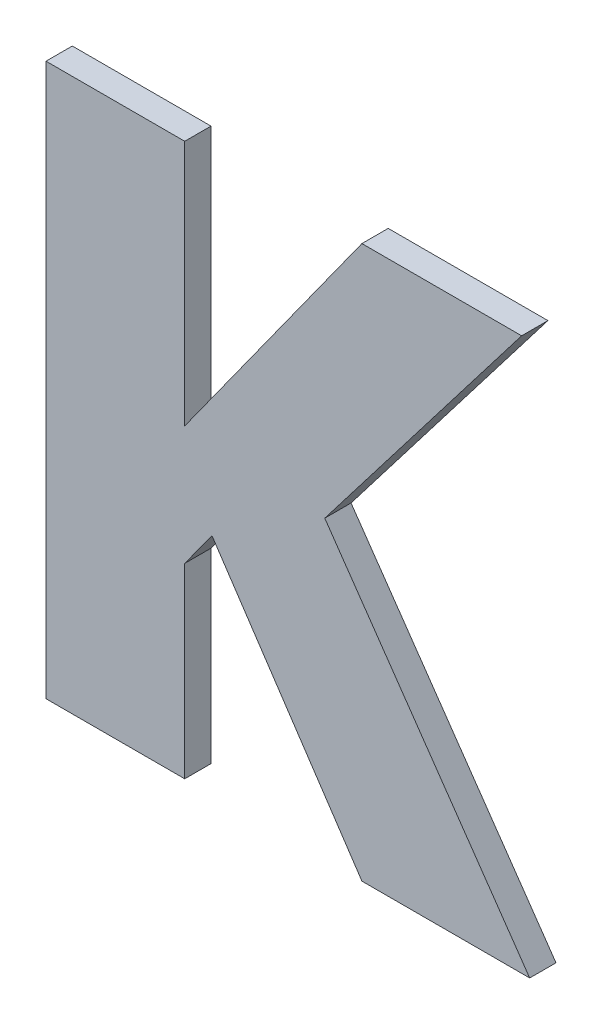
ISO-10303-21;
HEADER;
FILE_DESCRIPTION(('STEP AP214'),'2;1');
FILE_NAME('part.step','',(''),(''),'','','');
FILE_SCHEMA(('AUTOMOTIVE_DESIGN { 1 0 10303 214 1 1 1 1 }'));
ENDSEC;
DATA;
#1=APPLICATION_CONTEXT('core data for automotive mechanical design processes');
#2=APPLICATION_PROTOCOL_DEFINITION('international standard','automotive_design',2000,#1);
#3=PRODUCT_CONTEXT('',#1,'mechanical');
#4=PRODUCT('Part','Part','',(#3));
#5=PRODUCT_RELATED_PRODUCT_CATEGORY('part','',(#4));
#6=PRODUCT_DEFINITION_FORMATION('','',#4);
#7=PRODUCT_DEFINITION_CONTEXT('part definition',#1,'design');
#8=PRODUCT_DEFINITION('design','',#6,#7);
#9=PRODUCT_DEFINITION_SHAPE('','',#8);
#10=(LENGTH_UNIT() NAMED_UNIT(*) SI_UNIT(.MILLI.,.METRE.));
#11=(NAMED_UNIT(*) PLANE_ANGLE_UNIT() SI_UNIT($,.RADIAN.));
#12=(NAMED_UNIT(*) SI_UNIT($,.STERADIAN.) SOLID_ANGLE_UNIT());
#13=UNCERTAINTY_MEASURE_WITH_UNIT(LENGTH_MEASURE(1.E-05),#10,'distance_accuracy_value','');
#14=(GEOMETRIC_REPRESENTATION_CONTEXT(3) GLOBAL_UNCERTAINTY_ASSIGNED_CONTEXT((#13)) GLOBAL_UNIT_ASSIGNED_CONTEXT((#10,
#11,#12)) REPRESENTATION_CONTEXT('',''));
#15=CARTESIAN_POINT('',(0.,0.,0.));
#16=DIRECTION('',(0.,0.,1.));
#17=DIRECTION('',(1.,0.,0.));
#18=AXIS2_PLACEMENT_3D('',#15,#16,#17);
#19=CARTESIAN_POINT('',(3.9258033080139,-3.1428783858346,0.0475));
#20=DIRECTION('',(-0.831283694214455,-0.555848378366951,0.));
#21=DIRECTION('',(0.555848378366951,-0.831283694214455,0.));
#22=AXIS2_PLACEMENT_3D('',#19,#20,#21);
#23=PLANE('',#22);
#24=DIRECTION('',(-0.555848378366951,0.831283694214455,0.));
#25=VECTOR('',#24,1.);
#26=CARTESIAN_POINT('',(3.9543081693605,-3.1855080441471,0.0475));
#27=LINE('',#26,#25);
#28=CARTESIAN_POINT('',(3.9543081693605,-3.1855080441471,0.0475));
#29=VERTEX_POINT('',#28);
#30=CARTESIAN_POINT('',(3.9258033080139,-3.1428783858346,0.0475));
#31=VERTEX_POINT('',#30);
#32=EDGE_CURVE('E11',#29,#31,#27,.T.);
#33=ORIENTED_EDGE('',*,*,#32,.F.);
#34=DIRECTION('',(0.,0.,1.));
#35=VECTOR('',#34,1.);
#36=CARTESIAN_POINT('',(3.9543081693605,-3.1855080441471,0.0475));
#37=LINE('',#36,#35);
#38=CARTESIAN_POINT('',(3.9543081693605,-3.1855080441471,0.0525));
#39=VERTEX_POINT('',#38);
#40=EDGE_CURVE('E24',#29,#39,#37,.T.);
#41=ORIENTED_EDGE('',*,*,#40,.T.);
#42=DIRECTION('',(0.555848378366951,-0.831283694214455,0.));
#43=VECTOR('',#42,1.);
#44=CARTESIAN_POINT('',(3.9543081693605,-3.1855080441471,0.0525));
#45=LINE('',#44,#43);
#46=CARTESIAN_POINT('',(3.9258033080139,-3.1428783858346,0.0525));
#47=VERTEX_POINT('',#46);
#48=EDGE_CURVE('E124',#47,#39,#45,.T.);
#49=ORIENTED_EDGE('',*,*,#48,.F.);
#50=DIRECTION('',(0.,0.,1.));
#51=VECTOR('',#50,1.);
#52=CARTESIAN_POINT('',(3.9258033080139,-3.1428783858346,0.0475));
#53=LINE('',#52,#51);
#54=EDGE_CURVE('E197',#31,#47,#53,.T.);
#55=ORIENTED_EDGE('',*,*,#54,.F.);
#56=EDGE_LOOP('',(#33,#41,#49,#55));
#57=FACE_BOUND('',#56,.T.);
#58=ADVANCED_FACE('F17',(#57),#23,.T.);
#59=CARTESIAN_POINT('',(3.9206128705746,-3.1500258734559,0.0475));
#60=DIRECTION('',(0.809152433574184,-0.587598791047918,0.));
#61=DIRECTION('',(0.587598791047918,0.809152433574184,0.));
#62=AXIS2_PLACEMENT_3D('',#59,#60,#61);
#63=PLANE('',#62);
#64=DIRECTION('',(-0.587598791047918,-0.809152433574184,0.));
#65=VECTOR('',#64,1.);
#66=CARTESIAN_POINT('',(3.9258033080139,-3.1428783858346,0.0475));
#67=LINE('',#66,#65);
#68=CARTESIAN_POINT('',(3.9206128705746,-3.1500258734559,0.0475));
#69=VERTEX_POINT('',#68);
#70=EDGE_CURVE('E195',#31,#69,#67,.T.);
#71=ORIENTED_EDGE('',*,*,#70,.F.);
#72=ORIENTED_EDGE('',*,*,#54,.T.);
#73=DIRECTION('',(0.587598791047918,0.809152433574184,0.));
#74=VECTOR('',#73,1.);
#75=CARTESIAN_POINT('',(3.9258033080139,-3.1428783858346,0.0525));
#76=LINE('',#75,#74);
#77=CARTESIAN_POINT('',(3.9206128705746,-3.1500258734559,0.0525));
#78=VERTEX_POINT('',#77);
#79=EDGE_CURVE('E193',#78,#47,#76,.T.);
#80=ORIENTED_EDGE('',*,*,#79,.F.);
#81=DIRECTION('',(0.,0.,1.));
#82=VECTOR('',#81,1.);
#83=CARTESIAN_POINT('',(3.9206128705746,-3.1500258734559,0.0475));
#84=LINE('',#83,#82);
#85=EDGE_CURVE('E190',#69,#78,#84,.T.);
#86=ORIENTED_EDGE('',*,*,#85,.F.);
#87=EDGE_LOOP('',(#71,#72,#80,#86));
#88=FACE_BOUND('',#87,.T.);
#89=ADVANCED_FACE('F235',(#88),#63,.T.);
#90=CARTESIAN_POINT('',(3.9206128705746,-3.1855080441471,0.0475));
#91=DIRECTION('',(1.,0.,0.));
#92=DIRECTION('',(0.,1.,0.));
#93=AXIS2_PLACEMENT_3D('',#90,#91,#92);
#94=PLANE('',#93);
#95=DIRECTION('',(0.,-1.,0.));
#96=VECTOR('',#95,1.);
#97=CARTESIAN_POINT('',(3.9206128705746,-3.1500258734559,0.0475));
#98=LINE('',#97,#96);
#99=CARTESIAN_POINT('',(3.9206128705746,-3.1855080441471,0.0475));
#100=VERTEX_POINT('',#99);
#101=EDGE_CURVE('E188',#69,#100,#98,.T.);
#102=ORIENTED_EDGE('',*,*,#101,.F.);
#103=ORIENTED_EDGE('',*,*,#85,.T.);
#104=DIRECTION('',(0.,1.,0.));
#105=VECTOR('',#104,1.);
#106=CARTESIAN_POINT('',(3.9206128705746,-3.1500258734559,0.0525));
#107=LINE('',#106,#105);
#108=CARTESIAN_POINT('',(3.9206128705746,-3.1855080441471,0.0525));
#109=VERTEX_POINT('',#108);
#110=EDGE_CURVE('E185',#109,#78,#107,.T.);
#111=ORIENTED_EDGE('',*,*,#110,.F.);
#112=DIRECTION('',(0.,0.,1.));
#113=VECTOR('',#112,1.);
#114=CARTESIAN_POINT('',(3.9206128705746,-3.1855080441471,0.0475));
#115=LINE('',#114,#113);
#116=EDGE_CURVE('E182',#100,#109,#115,.T.);
#117=ORIENTED_EDGE('',*,*,#116,.F.);
#118=EDGE_LOOP('',(#102,#103,#111,#117));
#119=FACE_BOUND('',#118,.T.);
#120=ADVANCED_FACE('F231',(#119),#94,.T.);
#121=CARTESIAN_POINT('',(3.8942352376867,-3.1855080441471,0.0475));
#122=DIRECTION('',(0.,-1.,0.));
#123=DIRECTION('',(1.,0.,0.));
#124=AXIS2_PLACEMENT_3D('',#121,#122,#123);
#125=PLANE('',#124);
#126=DIRECTION('',(-1.,0.,0.));
#127=VECTOR('',#126,1.);
#128=CARTESIAN_POINT('',(3.9206128705746,-3.1855080441471,0.0475));
#129=LINE('',#128,#127);
#130=CARTESIAN_POINT('',(3.8942352376867,-3.1855080441471,0.0475));
#131=VERTEX_POINT('',#130);
#132=EDGE_CURVE('E180',#100,#131,#129,.T.);
#133=ORIENTED_EDGE('',*,*,#132,.F.);
#134=ORIENTED_EDGE('',*,*,#116,.T.);
#135=DIRECTION('',(1.,0.,0.));
#136=VECTOR('',#135,1.);
#137=CARTESIAN_POINT('',(3.9206128705746,-3.1855080441471,0.0525));
#138=LINE('',#137,#136);
#139=CARTESIAN_POINT('',(3.8942352376867,-3.1855080441471,0.0525));
#140=VERTEX_POINT('',#139);
#141=EDGE_CURVE('E177',#140,#109,#138,.T.);
#142=ORIENTED_EDGE('',*,*,#141,.F.);
#143=DIRECTION('',(0.,0.,1.));
#144=VECTOR('',#143,1.);
#145=CARTESIAN_POINT('',(3.8942352376867,-3.1855080441471,0.0475));
#146=LINE('',#145,#144);
#147=EDGE_CURVE('E174',#131,#140,#146,.T.);
#148=ORIENTED_EDGE('',*,*,#147,.F.);
#149=EDGE_LOOP('',(#133,#134,#142,#148));
#150=FACE_BOUND('',#149,.T.);
#151=ADVANCED_FACE('F227',(#150),#125,.T.);
#152=CARTESIAN_POINT('',(3.8942352376867,-3.0805080474254,0.0475));
#153=DIRECTION('',(-1.,0.,0.));
#154=DIRECTION('',(0.,-1.,0.));
#155=AXIS2_PLACEMENT_3D('',#152,#153,#154);
#156=PLANE('',#155);
#157=DIRECTION('',(0.,1.,0.));
#158=VECTOR('',#157,1.);
#159=CARTESIAN_POINT('',(3.8942352376867,-3.1855080441471,0.0475));
#160=LINE('',#159,#158);
#161=CARTESIAN_POINT('',(3.8942352376867,-3.0805080474254,0.0475));
#162=VERTEX_POINT('',#161);
#163=EDGE_CURVE('E172',#131,#162,#160,.T.);
#164=ORIENTED_EDGE('',*,*,#163,.F.);
#165=ORIENTED_EDGE('',*,*,#147,.T.);
#166=DIRECTION('',(0.,-1.,0.));
#167=VECTOR('',#166,1.);
#168=CARTESIAN_POINT('',(3.8942352376867,-3.1855080441471,0.0525));
#169=LINE('',#168,#167);
#170=CARTESIAN_POINT('',(3.8942352376867,-3.0805080474254,0.0525));
#171=VERTEX_POINT('',#170);
#172=EDGE_CURVE('E169',#171,#140,#169,.T.);
#173=ORIENTED_EDGE('',*,*,#172,.F.);
#174=DIRECTION('',(0.,0.,1.));
#175=VECTOR('',#174,1.);
#176=CARTESIAN_POINT('',(3.8942352376867,-3.0805080474254,0.0475));
#177=LINE('',#176,#175);
#178=EDGE_CURVE('E166',#162,#171,#177,.T.);
#179=ORIENTED_EDGE('',*,*,#178,.F.);
#180=EDGE_LOOP('',(#164,#165,#173,#179));
#181=FACE_BOUND('',#180,.T.);
#182=ADVANCED_FACE('F223',(#181),#156,.T.);
#183=CARTESIAN_POINT('',(3.9206128705746,-3.0805080474254,0.0475));
#184=DIRECTION('',(0.,1.,0.));
#185=DIRECTION('',(-1.,0.,0.));
#186=AXIS2_PLACEMENT_3D('',#183,#184,#185);
#187=PLANE('',#186);
#188=DIRECTION('',(1.,0.,0.));
#189=VECTOR('',#188,1.);
#190=CARTESIAN_POINT('',(3.8942352376867,-3.0805080474254,0.0475));
#191=LINE('',#190,#189);
#192=CARTESIAN_POINT('',(3.9206128705746,-3.0805080474254,0.0475));
#193=VERTEX_POINT('',#192);
#194=EDGE_CURVE('E164',#162,#193,#191,.T.);
#195=ORIENTED_EDGE('',*,*,#194,.F.);
#196=ORIENTED_EDGE('',*,*,#178,.T.);
#197=DIRECTION('',(-1.,0.,0.));
#198=VECTOR('',#197,1.);
#199=CARTESIAN_POINT('',(3.8942352376867,-3.0805080474254,0.0525));
#200=LINE('',#199,#198);
#201=CARTESIAN_POINT('',(3.9206128705746,-3.0805080474254,0.0525));
#202=VERTEX_POINT('',#201);
#203=EDGE_CURVE('E161',#202,#171,#200,.T.);
#204=ORIENTED_EDGE('',*,*,#203,.F.);
#205=DIRECTION('',(0.,0.,1.));
#206=VECTOR('',#205,1.);
#207=CARTESIAN_POINT('',(3.9206128705746,-3.0805080474254,0.0475));
#208=LINE('',#207,#206);
#209=EDGE_CURVE('E158',#193,#202,#208,.T.);
#210=ORIENTED_EDGE('',*,*,#209,.F.);
#211=EDGE_LOOP('',(#195,#196,#204,#210));
#212=FACE_BOUND('',#211,.T.);
#213=ADVANCED_FACE('F219',(#212),#187,.T.);
#214=CARTESIAN_POINT('',(3.9206128705746,-3.1273921626552,0.0475));
#215=DIRECTION('',(1.,0.,0.));
#216=DIRECTION('',(0.,1.,0.));
#217=AXIS2_PLACEMENT_3D('',#214,#215,#216);
#218=PLANE('',#217);
#219=DIRECTION('',(0.,-1.,0.));
#220=VECTOR('',#219,1.);
#221=CARTESIAN_POINT('',(3.9206128705746,-3.0805080474254,0.0475));
#222=LINE('',#221,#220);
#223=CARTESIAN_POINT('',(3.9206128705746,-3.1273921626552,0.0475));
#224=VERTEX_POINT('',#223);
#225=EDGE_CURVE('E156',#193,#224,#222,.T.);
#226=ORIENTED_EDGE('',*,*,#225,.F.);
#227=ORIENTED_EDGE('',*,*,#209,.T.);
#228=DIRECTION('',(0.,1.,0.));
#229=VECTOR('',#228,1.);
#230=CARTESIAN_POINT('',(3.9206128705746,-3.0805080474254,0.0525));
#231=LINE('',#230,#229);
#232=CARTESIAN_POINT('',(3.9206128705746,-3.1273921626552,0.0525));
#233=VERTEX_POINT('',#232);
#234=EDGE_CURVE('E153',#233,#202,#231,.T.);
#235=ORIENTED_EDGE('',*,*,#234,.F.);
#236=DIRECTION('',(0.,0.,1.));
#237=VECTOR('',#236,1.);
#238=CARTESIAN_POINT('',(3.9206128705746,-3.1273921626552,0.0475));
#239=LINE('',#238,#237);
#240=EDGE_CURVE('E150',#224,#233,#239,.T.);
#241=ORIENTED_EDGE('',*,*,#240,.F.);
#242=EDGE_LOOP('',(#226,#227,#235,#241));
#243=FACE_BOUND('',#242,.T.);
#244=ADVANCED_FACE('F215',(#243),#218,.T.);
#245=CARTESIAN_POINT('',(3.9543081693605,-3.0805080474254,0.0475));
#246=DIRECTION('',(-0.812037197104277,0.583605680677484,0.));
#247=DIRECTION('',(-0.583605680677484,-0.812037197104277,0.));
#248=AXIS2_PLACEMENT_3D('',#245,#246,#247);
#249=PLANE('',#248);
#250=DIRECTION('',(0.583605680677484,0.812037197104277,0.));
#251=VECTOR('',#250,1.);
#252=CARTESIAN_POINT('',(3.9206128705746,-3.1273921626552,0.0475));
#253=LINE('',#252,#251);
#254=CARTESIAN_POINT('',(3.9543081693605,-3.0805080474254,0.0475));
#255=VERTEX_POINT('',#254);
#256=EDGE_CURVE('E148',#224,#255,#253,.T.);
#257=ORIENTED_EDGE('',*,*,#256,.F.);
#258=ORIENTED_EDGE('',*,*,#240,.T.);
#259=DIRECTION('',(-0.583605680677484,-0.812037197104277,0.));
#260=VECTOR('',#259,1.);
#261=CARTESIAN_POINT('',(3.9206128705746,-3.1273921626552,0.0525));
#262=LINE('',#261,#260);
#263=CARTESIAN_POINT('',(3.9543081693605,-3.0805080474254,0.0525));
#264=VERTEX_POINT('',#263);
#265=EDGE_CURVE('E145',#264,#233,#262,.T.);
#266=ORIENTED_EDGE('',*,*,#265,.F.);
#267=DIRECTION('',(0.,0.,1.));
#268=VECTOR('',#267,1.);
#269=CARTESIAN_POINT('',(3.9543081693605,-3.0805080474254,0.0475));
#270=LINE('',#269,#268);
#271=EDGE_CURVE('E142',#255,#264,#270,.T.);
#272=ORIENTED_EDGE('',*,*,#271,.F.);
#273=EDGE_LOOP('',(#257,#258,#266,#272));
#274=FACE_BOUND('',#273,.T.);
#275=ADVANCED_FACE('F211',(#274),#249,.T.);
#276=CARTESIAN_POINT('',(3.9846849917509,-3.0805080474254,0.0475));
#277=DIRECTION('',(0.,1.,0.));
#278=DIRECTION('',(-1.,0.,0.));
#279=AXIS2_PLACEMENT_3D('',#276,#277,#278);
#280=PLANE('',#279);
#281=DIRECTION('',(1.,0.,0.));
#282=VECTOR('',#281,1.);
#283=CARTESIAN_POINT('',(3.9543081693605,-3.0805080474254,0.0475));
#284=LINE('',#283,#282);
#285=CARTESIAN_POINT('',(3.9846849917509,-3.0805080474254,0.0475));
#286=VERTEX_POINT('',#285);
#287=EDGE_CURVE('E140',#255,#286,#284,.T.);
#288=ORIENTED_EDGE('',*,*,#287,.F.);
#289=ORIENTED_EDGE('',*,*,#271,.T.);
#290=DIRECTION('',(-1.,0.,0.));
#291=VECTOR('',#290,1.);
#292=CARTESIAN_POINT('',(3.9543081693605,-3.0805080474254,0.0525));
#293=LINE('',#292,#291);
#294=CARTESIAN_POINT('',(3.9846849917509,-3.0805080474254,0.0525));
#295=VERTEX_POINT('',#294);
#296=EDGE_CURVE('E137',#295,#264,#293,.T.);
#297=ORIENTED_EDGE('',*,*,#296,.F.);
#298=DIRECTION('',(0.,0.,1.));
#299=VECTOR('',#298,1.);
#300=CARTESIAN_POINT('',(3.9846849917509,-3.0805080474254,0.0475));
#301=LINE('',#300,#299);
#302=EDGE_CURVE('E134',#286,#295,#301,.T.);
#303=ORIENTED_EDGE('',*,*,#302,.F.);
#304=EDGE_LOOP('',(#288,#289,#297,#303));
#305=FACE_BOUND('',#304,.T.);
#306=ADVANCED_FACE('F207',(#305),#280,.T.);
#307=CARTESIAN_POINT('',(3.9472457708776,-3.1292641236989,0.0475));
#308=DIRECTION('',(0.793138273917805,-0.609041606498838,0.));
#309=DIRECTION('',(0.609041606498838,0.793138273917805,0.));
#310=AXIS2_PLACEMENT_3D('',#307,#308,#309);
#311=PLANE('',#310);
#312=DIRECTION('',(-0.609041606498838,-0.793138273917805,0.));
#313=VECTOR('',#312,1.);
#314=CARTESIAN_POINT('',(3.9846849917509,-3.0805080474254,0.0475));
#315=LINE('',#314,#313);
#316=CARTESIAN_POINT('',(3.9472457708776,-3.1292641236989,0.0475));
#317=VERTEX_POINT('',#316);
#318=EDGE_CURVE('E132',#286,#317,#315,.T.);
#319=ORIENTED_EDGE('',*,*,#318,.F.);
#320=ORIENTED_EDGE('',*,*,#302,.T.);
#321=DIRECTION('',(0.609041606498838,0.793138273917805,0.));
#322=VECTOR('',#321,1.);
#323=CARTESIAN_POINT('',(3.9846849917509,-3.0805080474254,0.0525));
#324=LINE('',#323,#322);
#325=CARTESIAN_POINT('',(3.9472457708776,-3.1292641236989,0.0525));
#326=VERTEX_POINT('',#325);
#327=EDGE_CURVE('E130',#326,#295,#324,.T.);
#328=ORIENTED_EDGE('',*,*,#327,.F.);
#329=DIRECTION('',(0.,0.,1.));
#330=VECTOR('',#329,1.);
#331=CARTESIAN_POINT('',(3.9472457708776,-3.1292641236989,0.0475));
#332=LINE('',#331,#330);
#333=EDGE_CURVE('E109',#317,#326,#332,.T.);
#334=ORIENTED_EDGE('',*,*,#333,.F.);
#335=EDGE_LOOP('',(#319,#320,#328,#334));
#336=FACE_BOUND('',#335,.T.);
#337=ADVANCED_FACE('F205',(#336),#311,.T.);
#338=CARTESIAN_POINT('',(3.9862165962411,-3.1855080441471,0.0475));
#339=DIRECTION('',(0.821968294045382,0.569533250639614,0.));
#340=DIRECTION('',(-0.569533250639614,0.821968294045382,0.));
#341=AXIS2_PLACEMENT_3D('',#338,#339,#340);
#342=PLANE('',#341);
#343=DIRECTION('',(0.569533250639614,-0.821968294045382,0.));
#344=VECTOR('',#343,1.);
#345=CARTESIAN_POINT('',(3.9472457708776,-3.1292641236989,0.0475));
#346=LINE('',#345,#344);
#347=CARTESIAN_POINT('',(3.9862165962411,-3.1855080441471,0.0475));
#348=VERTEX_POINT('',#347);
#349=EDGE_CURVE('E113',#317,#348,#346,.T.);
#350=ORIENTED_EDGE('',*,*,#349,.F.);
#351=ORIENTED_EDGE('',*,*,#333,.T.);
#352=DIRECTION('',(-0.569533250639614,0.821968294045382,0.));
#353=VECTOR('',#352,1.);
#354=CARTESIAN_POINT('',(3.9472457708776,-3.1292641236989,0.0525));
#355=LINE('',#354,#353);
#356=CARTESIAN_POINT('',(3.9862165962411,-3.1855080441471,0.0525));
#357=VERTEX_POINT('',#356);
#358=EDGE_CURVE('E102',#357,#326,#355,.T.);
#359=ORIENTED_EDGE('',*,*,#358,.F.);
#360=DIRECTION('',(0.,0.,1.));
#361=VECTOR('',#360,1.);
#362=CARTESIAN_POINT('',(3.9862165962411,-3.1855080441471,0.0475));
#363=LINE('',#362,#361);
#364=EDGE_CURVE('E106',#348,#357,#363,.T.);
#365=ORIENTED_EDGE('',*,*,#364,.F.);
#366=EDGE_LOOP('',(#350,#351,#359,#365));
#367=FACE_BOUND('',#366,.T.);
#368=ADVANCED_FACE('F105',(#367),#342,.T.);
#369=CARTESIAN_POINT('',(3.9543081693605,-3.1855080441471,0.0475));
#370=DIRECTION('',(0.,-1.,0.));
#371=DIRECTION('',(1.,0.,0.));
#372=AXIS2_PLACEMENT_3D('',#369,#370,#371);
#373=PLANE('',#372);
#374=DIRECTION('',(-1.,0.,0.));
#375=VECTOR('',#374,1.);
#376=CARTESIAN_POINT('',(3.9862165962411,-3.1855080441471,0.0475));
#377=LINE('',#376,#375);
#378=EDGE_CURVE('E119',#348,#29,#377,.T.);
#379=ORIENTED_EDGE('',*,*,#378,.F.);
#380=ORIENTED_EDGE('',*,*,#364,.T.);
#381=DIRECTION('',(1.,0.,0.));
#382=VECTOR('',#381,1.);
#383=CARTESIAN_POINT('',(3.9862165962411,-3.1855080441471,0.0525));
#384=LINE('',#383,#382);
#385=EDGE_CURVE('E118',#39,#357,#384,.T.);
#386=ORIENTED_EDGE('',*,*,#385,.F.);
#387=ORIENTED_EDGE('',*,*,#40,.F.);
#388=EDGE_LOOP('',(#379,#380,#386,#387));
#389=FACE_BOUND('',#388,.T.);
#390=ADVANCED_FACE('F117',(#389),#373,.T.);
#391=CARTESIAN_POINT('',(3.9343181753032,-3.1328826718505,0.0475));
#392=DIRECTION('',(0.,0.,1.));
#393=DIRECTION('',(1.,0.,0.));
#394=AXIS2_PLACEMENT_3D('',#391,#392,#393);
#395=PLANE('',#394);
#396=ORIENTED_EDGE('',*,*,#378,.T.);
#397=ORIENTED_EDGE('',*,*,#32,.T.);
#398=ORIENTED_EDGE('',*,*,#70,.T.);
#399=ORIENTED_EDGE('',*,*,#101,.T.);
#400=ORIENTED_EDGE('',*,*,#132,.T.);
#401=ORIENTED_EDGE('',*,*,#163,.T.);
#402=ORIENTED_EDGE('',*,*,#194,.T.);
#403=ORIENTED_EDGE('',*,*,#225,.T.);
#404=ORIENTED_EDGE('',*,*,#256,.T.);
#405=ORIENTED_EDGE('',*,*,#287,.T.);
#406=ORIENTED_EDGE('',*,*,#318,.T.);
#407=ORIENTED_EDGE('',*,*,#349,.T.);
#408=EDGE_LOOP('',(#396,#397,#398,#399,#400,#401,#402,#403,#404,#405,#406,#407));
#409=FACE_BOUND('',#408,.T.);
#410=ADVANCED_FACE('F200',(#409),#395,.F.);
#411=CARTESIAN_POINT('',(3.9343181753032,-3.1328826718505,0.0525));
#412=DIRECTION('',(0.,0.,1.));
#413=DIRECTION('',(1.,0.,0.));
#414=AXIS2_PLACEMENT_3D('',#411,#412,#413);
#415=PLANE('',#414);
#416=ORIENTED_EDGE('',*,*,#385,.T.);
#417=ORIENTED_EDGE('',*,*,#358,.T.);
#418=ORIENTED_EDGE('',*,*,#327,.T.);
#419=ORIENTED_EDGE('',*,*,#296,.T.);
#420=ORIENTED_EDGE('',*,*,#265,.T.);
#421=ORIENTED_EDGE('',*,*,#234,.T.);
#422=ORIENTED_EDGE('',*,*,#203,.T.);
#423=ORIENTED_EDGE('',*,*,#172,.T.);
#424=ORIENTED_EDGE('',*,*,#141,.T.);
#425=ORIENTED_EDGE('',*,*,#110,.T.);
#426=ORIENTED_EDGE('',*,*,#79,.T.);
#427=ORIENTED_EDGE('',*,*,#48,.T.);
#428=EDGE_LOOP('',(#416,#417,#418,#419,#420,#421,#422,#423,#424,#425,#426,#427));
#429=FACE_BOUND('',#428,.T.);
#430=ADVANCED_FACE('F122',(#429),#415,.T.);
#431=CLOSED_SHELL('',(#58,#89,#120,#151,#182,#213,#244,#275,#306,#337,#368,#390,#410,#430));
#432=MANIFOLD_SOLID_BREP('B1',#431);
#433=ADVANCED_BREP_SHAPE_REPRESENTATION('',(#18,#432),#14);
#434=SHAPE_DEFINITION_REPRESENTATION(#9,#433);
ENDSEC;
END-ISO-10303-21;
